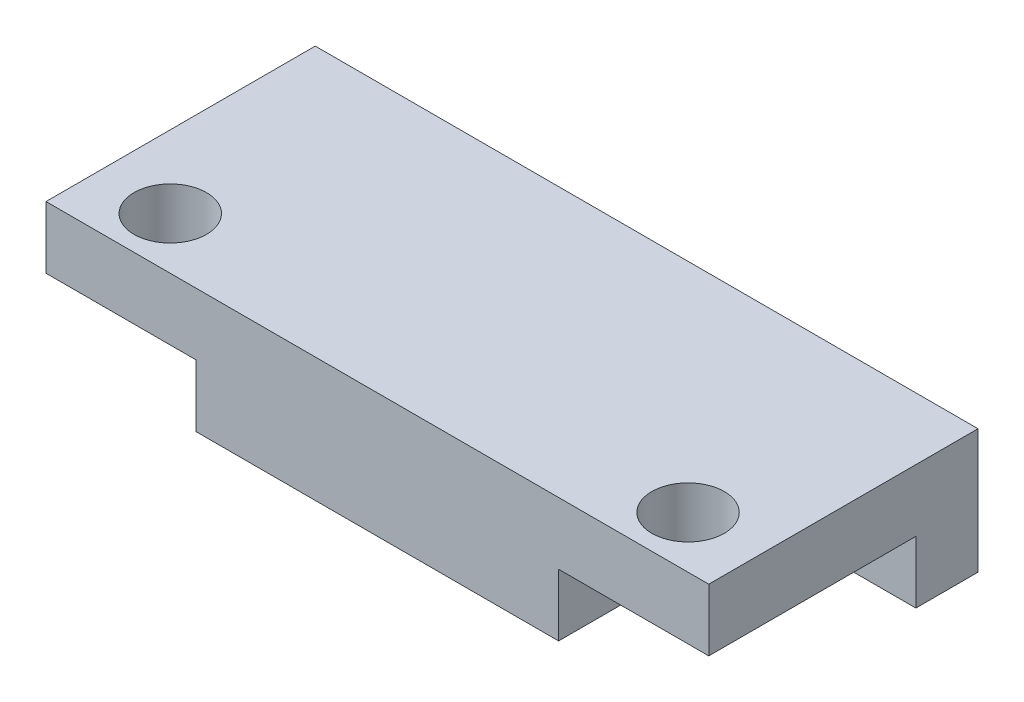
ISO-10303-21;
HEADER;
FILE_DESCRIPTION(('STEP AP214'),'2;1');
FILE_NAME('part.step','',(''),(''),'','','');
FILE_SCHEMA(('AUTOMOTIVE_DESIGN { 1 0 10303 214 1 1 1 1 }'));
ENDSEC;
DATA;
#1=APPLICATION_CONTEXT('core data for automotive mechanical design processes');
#2=APPLICATION_PROTOCOL_DEFINITION('international standard','automotive_design',2000,#1);
#3=PRODUCT_CONTEXT('',#1,'mechanical');
#4=PRODUCT('Part','Part','',(#3));
#5=PRODUCT_RELATED_PRODUCT_CATEGORY('part','',(#4));
#6=PRODUCT_DEFINITION_FORMATION('','',#4);
#7=PRODUCT_DEFINITION_CONTEXT('part definition',#1,'design');
#8=PRODUCT_DEFINITION('design','',#6,#7);
#9=PRODUCT_DEFINITION_SHAPE('','',#8);
#10=(LENGTH_UNIT() NAMED_UNIT(*) SI_UNIT(.MILLI.,.METRE.));
#11=(NAMED_UNIT(*) PLANE_ANGLE_UNIT() SI_UNIT($,.RADIAN.));
#12=(NAMED_UNIT(*) SI_UNIT($,.STERADIAN.) SOLID_ANGLE_UNIT());
#13=UNCERTAINTY_MEASURE_WITH_UNIT(LENGTH_MEASURE(1.E-05),#10,'distance_accuracy_value','');
#14=(GEOMETRIC_REPRESENTATION_CONTEXT(3) GLOBAL_UNCERTAINTY_ASSIGNED_CONTEXT((#13)) GLOBAL_UNIT_ASSIGNED_CONTEXT((#10,
#11,#12)) REPRESENTATION_CONTEXT('',''));
#15=CARTESIAN_POINT('',(0.,0.,0.));
#16=DIRECTION('',(0.,0.,1.));
#17=DIRECTION('',(1.,0.,0.));
#18=AXIS2_PLACEMENT_3D('',#15,#16,#17);
#19=CARTESIAN_POINT('',(0.,0.,0.));
#20=DIRECTION('',(0.,1.,0.));
#21=DIRECTION('',(0.,0.,1.));
#22=AXIS2_PLACEMENT_3D('',#19,#20,#21);
#23=PLANE('',#22);
#24=CARTESIAN_POINT('',(12.5,0.,4.));
#25=DIRECTION('',(0.,1.,0.));
#26=DIRECTION('',(0.,0.,1.));
#27=AXIS2_PLACEMENT_3D('',#24,#25,#26);
#28=CIRCLE('',#27,1.75);
#29=CARTESIAN_POINT('',(12.5,0.,5.75));
#30=VERTEX_POINT('',#29);
#31=EDGE_CURVE('E149',#30,#30,#28,.T.);
#32=ORIENTED_EDGE('',*,*,#31,.T.);
#33=EDGE_LOOP('',(#32));
#34=FACE_BOUND('',#33,.T.);
#35=DIRECTION('',(0.,0.,1.));
#36=VECTOR('',#35,1.);
#37=CARTESIAN_POINT('',(8.75,0.,6.5));
#38=LINE('',#37,#36);
#39=CARTESIAN_POINT('',(8.75,0.,-3.5));
#40=VERTEX_POINT('',#39);
#41=CARTESIAN_POINT('',(8.75,0.,6.5));
#42=VERTEX_POINT('',#41);
#43=EDGE_CURVE('E61',#40,#42,#38,.T.);
#44=ORIENTED_EDGE('',*,*,#43,.F.);
#45=DIRECTION('',(-1.,0.,0.));
#46=VECTOR('',#45,1.);
#47=CARTESIAN_POINT('',(8.75,0.,-3.5));
#48=LINE('',#47,#46);
#49=CARTESIAN_POINT('',(16.,0.,-3.49999999999999));
#50=VERTEX_POINT('',#49);
#51=EDGE_CURVE('E212',#50,#40,#48,.T.);
#52=ORIENTED_EDGE('',*,*,#51,.F.);
#53=DIRECTION('',(0.,0.,-1.));
#54=VECTOR('',#53,1.);
#55=CARTESIAN_POINT('',(16.,0.,6.5));
#56=LINE('',#55,#54);
#57=CARTESIAN_POINT('',(16.,0.,6.5));
#58=VERTEX_POINT('',#57);
#59=EDGE_CURVE('E177',#58,#50,#56,.T.);
#60=ORIENTED_EDGE('',*,*,#59,.F.);
#61=DIRECTION('',(1.,0.,0.));
#62=VECTOR('',#61,1.);
#63=CARTESIAN_POINT('',(16.,0.,6.5));
#64=LINE('',#63,#62);
#65=EDGE_CURVE('E189',#42,#58,#64,.T.);
#66=ORIENTED_EDGE('',*,*,#65,.F.);
#67=EDGE_LOOP('',(#44,#52,#60,#66));
#68=FACE_BOUND('',#67,.T.);
#69=ADVANCED_FACE('F45',(#34,#68),#23,.F.);
#70=CARTESIAN_POINT('',(-12.5,0.,4.));
#71=DIRECTION('',(0.,1.,0.));
#72=DIRECTION('',(0.,0.,1.));
#73=AXIS2_PLACEMENT_3D('',#70,#71,#72);
#74=CIRCLE('',#73,1.75);
#75=CARTESIAN_POINT('',(-12.5,0.,5.75));
#76=VERTEX_POINT('',#75);
#77=EDGE_CURVE('E160',#76,#76,#74,.T.);
#78=ORIENTED_EDGE('',*,*,#77,.T.);
#79=EDGE_LOOP('',(#78));
#80=FACE_BOUND('',#79,.T.);
#81=DIRECTION('',(0.,0.,-1.));
#82=VECTOR('',#81,1.);
#83=CARTESIAN_POINT('',(-8.75,0.,6.5));
#84=LINE('',#83,#82);
#85=CARTESIAN_POINT('',(-8.75,0.,6.5));
#86=VERTEX_POINT('',#85);
#87=CARTESIAN_POINT('',(-8.75,0.,-3.5));
#88=VERTEX_POINT('',#87);
#89=EDGE_CURVE('E147',#86,#88,#84,.T.);
#90=ORIENTED_EDGE('',*,*,#89,.F.);
#91=CARTESIAN_POINT('',(-16.,0.,6.5));
#92=VERTEX_POINT('',#91);
#93=EDGE_CURVE('E190',#92,#86,#64,.T.);
#94=ORIENTED_EDGE('',*,*,#93,.F.);
#95=DIRECTION('',(0.,0.,1.));
#96=VECTOR('',#95,1.);
#97=CARTESIAN_POINT('',(-16.,0.,6.5));
#98=LINE('',#97,#96);
#99=CARTESIAN_POINT('',(-16.,0.,-3.5));
#100=VERTEX_POINT('',#99);
#101=EDGE_CURVE('E164',#100,#92,#98,.T.);
#102=ORIENTED_EDGE('',*,*,#101,.F.);
#103=DIRECTION('',(-1.,0.,0.));
#104=VECTOR('',#103,1.);
#105=CARTESIAN_POINT('',(-16.,0.,-3.5));
#106=LINE('',#105,#104);
#107=EDGE_CURVE('E69',#88,#100,#106,.T.);
#108=ORIENTED_EDGE('',*,*,#107,.F.);
#109=EDGE_LOOP('',(#90,#94,#102,#108));
#110=FACE_BOUND('',#109,.T.);
#111=ADVANCED_FACE('F262',(#80,#110),#23,.F.);
#112=CARTESIAN_POINT('',(-16.,3.,6.5));
#113=DIRECTION('',(1.,0.,0.));
#114=DIRECTION('',(0.,0.,-1.));
#115=AXIS2_PLACEMENT_3D('',#112,#113,#114);
#116=PLANE('',#115);
#117=DIRECTION('',(0.,-1.,0.));
#118=VECTOR('',#117,1.);
#119=CARTESIAN_POINT('',(-16.,3.,-6.5));
#120=LINE('',#119,#118);
#121=CARTESIAN_POINT('',(-16.,3.,-6.5));
#122=VERTEX_POINT('',#121);
#123=CARTESIAN_POINT('',(-16.,-3.,-6.5));
#124=VERTEX_POINT('',#123);
#125=EDGE_CURVE('E186',#122,#124,#120,.T.);
#126=ORIENTED_EDGE('',*,*,#125,.T.);
#127=DIRECTION('',(0.,0.,-1.));
#128=VECTOR('',#127,1.);
#129=CARTESIAN_POINT('',(-16.,-3.,-6.5));
#130=LINE('',#129,#128);
#131=CARTESIAN_POINT('',(-16.,-3.,-3.5));
#132=VERTEX_POINT('',#131);
#133=EDGE_CURVE('E134',#132,#124,#130,.T.);
#134=ORIENTED_EDGE('',*,*,#133,.F.);
#135=DIRECTION('',(0.,1.,0.));
#136=VECTOR('',#135,1.);
#137=CARTESIAN_POINT('',(-16.,-3.,-3.5));
#138=LINE('',#137,#136);
#139=EDGE_CURVE('E129',#132,#100,#138,.T.);
#140=ORIENTED_EDGE('',*,*,#139,.T.);
#141=ORIENTED_EDGE('',*,*,#101,.T.);
#142=DIRECTION('',(0.,-1.,0.));
#143=VECTOR('',#142,1.);
#144=CARTESIAN_POINT('',(-16.,3.,6.5));
#145=LINE('',#144,#143);
#146=CARTESIAN_POINT('',(-16.,3.,6.5));
#147=VERTEX_POINT('',#146);
#148=EDGE_CURVE('E11',#147,#92,#145,.T.);
#149=ORIENTED_EDGE('',*,*,#148,.F.);
#150=DIRECTION('',(0.,0.,1.));
#151=VECTOR('',#150,1.);
#152=CARTESIAN_POINT('',(-16.,3.,6.5));
#153=LINE('',#152,#151);
#154=EDGE_CURVE('E172',#122,#147,#153,.T.);
#155=ORIENTED_EDGE('',*,*,#154,.F.);
#156=EDGE_LOOP('',(#126,#134,#140,#141,#149,#155));
#157=FACE_BOUND('',#156,.T.);
#158=ADVANCED_FACE('F47',(#157),#116,.F.);
#159=CARTESIAN_POINT('',(16.,3.,6.5));
#160=DIRECTION('',(0.,0.,-1.));
#161=DIRECTION('',(-1.,0.,0.));
#162=AXIS2_PLACEMENT_3D('',#159,#160,#161);
#163=PLANE('',#162);
#164=ORIENTED_EDGE('',*,*,#93,.T.);
#165=DIRECTION('',(0.,1.,0.));
#166=VECTOR('',#165,1.);
#167=CARTESIAN_POINT('',(-8.75,-3.,6.5));
#168=LINE('',#167,#166);
#169=CARTESIAN_POINT('',(-8.75,-3.,6.5));
#170=VERTEX_POINT('',#169);
#171=EDGE_CURVE('E224',#170,#86,#168,.T.);
#172=ORIENTED_EDGE('',*,*,#171,.F.);
#173=DIRECTION('',(-1.,0.,0.));
#174=VECTOR('',#173,1.);
#175=CARTESIAN_POINT('',(-8.75,-3.,6.5));
#176=LINE('',#175,#174);
#177=CARTESIAN_POINT('',(8.75,-3.,6.5));
#178=VERTEX_POINT('',#177);
#179=EDGE_CURVE('E140',#178,#170,#176,.T.);
#180=ORIENTED_EDGE('',*,*,#179,.F.);
#181=DIRECTION('',(0.,1.,0.));
#182=VECTOR('',#181,1.);
#183=CARTESIAN_POINT('',(8.75,-3.,6.5));
#184=LINE('',#183,#182);
#185=EDGE_CURVE('E227',#178,#42,#184,.T.);
#186=ORIENTED_EDGE('',*,*,#185,.T.);
#187=ORIENTED_EDGE('',*,*,#65,.T.);
#188=DIRECTION('',(0.,-1.,0.));
#189=VECTOR('',#188,1.);
#190=CARTESIAN_POINT('',(16.,3.,6.5));
#191=LINE('',#190,#189);
#192=CARTESIAN_POINT('',(16.,3.,6.5));
#193=VERTEX_POINT('',#192);
#194=EDGE_CURVE('E54',#193,#58,#191,.T.);
#195=ORIENTED_EDGE('',*,*,#194,.F.);
#196=DIRECTION('',(1.,0.,0.));
#197=VECTOR('',#196,1.);
#198=CARTESIAN_POINT('',(16.,3.,6.5));
#199=LINE('',#198,#197);
#200=EDGE_CURVE('E176',#147,#193,#199,.T.);
#201=ORIENTED_EDGE('',*,*,#200,.F.);
#202=ORIENTED_EDGE('',*,*,#148,.T.);
#203=EDGE_LOOP('',(#164,#172,#180,#186,#187,#195,#201,#202));
#204=FACE_BOUND('',#203,.T.);
#205=ADVANCED_FACE('F259',(#204),#163,.F.);
#206=CARTESIAN_POINT('',(16.,3.,6.5));
#207=DIRECTION('',(-1.,0.,0.));
#208=DIRECTION('',(0.,0.,1.));
#209=AXIS2_PLACEMENT_3D('',#206,#207,#208);
#210=PLANE('',#209);
#211=ORIENTED_EDGE('',*,*,#59,.T.);
#212=DIRECTION('',(0.,1.,0.));
#213=VECTOR('',#212,1.);
#214=CARTESIAN_POINT('',(16.,-3.,-3.5));
#215=LINE('',#214,#213);
#216=CARTESIAN_POINT('',(16.,-3.,-3.5));
#217=VERTEX_POINT('',#216);
#218=EDGE_CURVE('E156',#217,#50,#215,.T.);
#219=ORIENTED_EDGE('',*,*,#218,.F.);
#220=DIRECTION('',(0.,0.,1.));
#221=VECTOR('',#220,1.);
#222=CARTESIAN_POINT('',(16.,-3.,-3.5));
#223=LINE('',#222,#221);
#224=CARTESIAN_POINT('',(16.,-3.,-6.5));
#225=VERTEX_POINT('',#224);
#226=EDGE_CURVE('E238',#225,#217,#223,.T.);
#227=ORIENTED_EDGE('',*,*,#226,.F.);
#228=DIRECTION('',(0.,-1.,0.));
#229=VECTOR('',#228,1.);
#230=CARTESIAN_POINT('',(16.,3.,-6.5));
#231=LINE('',#230,#229);
#232=CARTESIAN_POINT('',(16.,3.,-6.5));
#233=VERTEX_POINT('',#232);
#234=EDGE_CURVE('E199',#233,#225,#231,.T.);
#235=ORIENTED_EDGE('',*,*,#234,.F.);
#236=DIRECTION('',(0.,0.,-1.));
#237=VECTOR('',#236,1.);
#238=CARTESIAN_POINT('',(16.,3.,6.5));
#239=LINE('',#238,#237);
#240=EDGE_CURVE('E180',#193,#233,#239,.T.);
#241=ORIENTED_EDGE('',*,*,#240,.F.);
#242=ORIENTED_EDGE('',*,*,#194,.T.);
#243=EDGE_LOOP('',(#211,#219,#227,#235,#241,#242));
#244=FACE_BOUND('',#243,.T.);
#245=ADVANCED_FACE('F207',(#244),#210,.F.);
#246=CARTESIAN_POINT('',(16.,3.,-6.5));
#247=DIRECTION('',(0.,0.,1.));
#248=DIRECTION('',(1.,0.,0.));
#249=AXIS2_PLACEMENT_3D('',#246,#247,#248);
#250=PLANE('',#249);
#251=ORIENTED_EDGE('',*,*,#234,.T.);
#252=DIRECTION('',(1.,0.,0.));
#253=VECTOR('',#252,1.);
#254=CARTESIAN_POINT('',(-16.,-3.,-6.5));
#255=LINE('',#254,#253);
#256=EDGE_CURVE('E242',#124,#225,#255,.T.);
#257=ORIENTED_EDGE('',*,*,#256,.F.);
#258=ORIENTED_EDGE('',*,*,#125,.F.);
#259=DIRECTION('',(-1.,0.,0.));
#260=VECTOR('',#259,1.);
#261=CARTESIAN_POINT('',(16.,3.,-6.5));
#262=LINE('',#261,#260);
#263=EDGE_CURVE('E183',#233,#122,#262,.T.);
#264=ORIENTED_EDGE('',*,*,#263,.F.);
#265=EDGE_LOOP('',(#251,#257,#258,#264));
#266=FACE_BOUND('',#265,.T.);
#267=ADVANCED_FACE('F269',(#266),#250,.F.);
#268=CARTESIAN_POINT('',(0.,3.,0.));
#269=DIRECTION('',(0.,1.,0.));
#270=DIRECTION('',(0.,0.,1.));
#271=AXIS2_PLACEMENT_3D('',#268,#269,#270);
#272=PLANE('',#271);
#273=CARTESIAN_POINT('',(-12.5,3.,4.));
#274=DIRECTION('',(0.,1.,0.));
#275=DIRECTION('',(0.,0.,1.));
#276=AXIS2_PLACEMENT_3D('',#273,#274,#275);
#277=CIRCLE('',#276,1.75);
#278=CARTESIAN_POINT('',(-12.5,3.,5.75));
#279=VERTEX_POINT('',#278);
#280=EDGE_CURVE('E165',#279,#279,#277,.T.);
#281=ORIENTED_EDGE('',*,*,#280,.F.);
#282=EDGE_LOOP('',(#281));
#283=FACE_BOUND('',#282,.T.);
#284=CARTESIAN_POINT('',(12.5,3.,4.));
#285=DIRECTION('',(0.,1.,0.));
#286=DIRECTION('',(0.,0.,1.));
#287=AXIS2_PLACEMENT_3D('',#284,#285,#286);
#288=CIRCLE('',#287,1.75);
#289=CARTESIAN_POINT('',(12.5,3.,5.75));
#290=VERTEX_POINT('',#289);
#291=EDGE_CURVE('E154',#290,#290,#288,.T.);
#292=ORIENTED_EDGE('',*,*,#291,.F.);
#293=EDGE_LOOP('',(#292));
#294=FACE_BOUND('',#293,.T.);
#295=ORIENTED_EDGE('',*,*,#154,.T.);
#296=ORIENTED_EDGE('',*,*,#200,.T.);
#297=ORIENTED_EDGE('',*,*,#240,.T.);
#298=ORIENTED_EDGE('',*,*,#263,.T.);
#299=EDGE_LOOP('',(#295,#296,#297,#298));
#300=FACE_BOUND('',#299,.T.);
#301=ADVANCED_FACE('F271',(#283,#294,#300),#272,.T.);
#302=CARTESIAN_POINT('',(12.5,0.,4.));
#303=DIRECTION('',(0.,1.,0.));
#304=DIRECTION('',(0.,0.,1.));
#305=AXIS2_PLACEMENT_3D('',#302,#303,#304);
#306=CYLINDRICAL_SURFACE('',#305,1.75);
#307=ORIENTED_EDGE('',*,*,#31,.F.);
#308=EDGE_LOOP('',(#307));
#309=FACE_BOUND('',#308,.T.);
#310=ORIENTED_EDGE('',*,*,#291,.T.);
#311=EDGE_LOOP('',(#310));
#312=FACE_BOUND('',#311,.T.);
#313=ADVANCED_FACE('F273',(#309,#312),#306,.F.);
#314=CARTESIAN_POINT('',(-12.5,0.,4.));
#315=DIRECTION('',(0.,1.,0.));
#316=DIRECTION('',(0.,0.,1.));
#317=AXIS2_PLACEMENT_3D('',#314,#315,#316);
#318=CYLINDRICAL_SURFACE('',#317,1.75);
#319=ORIENTED_EDGE('',*,*,#77,.F.);
#320=EDGE_LOOP('',(#319));
#321=FACE_BOUND('',#320,.T.);
#322=ORIENTED_EDGE('',*,*,#280,.T.);
#323=EDGE_LOOP('',(#322));
#324=FACE_BOUND('',#323,.T.);
#325=ADVANCED_FACE('F279',(#321,#324),#318,.F.);
#326=CARTESIAN_POINT('',(-8.75,-3.,6.5));
#327=DIRECTION('',(1.,0.,0.));
#328=DIRECTION('',(0.,0.,-1.));
#329=AXIS2_PLACEMENT_3D('',#326,#327,#328);
#330=PLANE('',#329);
#331=ORIENTED_EDGE('',*,*,#89,.T.);
#332=DIRECTION('',(0.,1.,0.));
#333=VECTOR('',#332,1.);
#334=CARTESIAN_POINT('',(-8.75,-3.,-3.5));
#335=LINE('',#334,#333);
#336=CARTESIAN_POINT('',(-8.75,-3.,-3.5));
#337=VERTEX_POINT('',#336);
#338=EDGE_CURVE('E126',#337,#88,#335,.T.);
#339=ORIENTED_EDGE('',*,*,#338,.F.);
#340=DIRECTION('',(0.,0.,-1.));
#341=VECTOR('',#340,1.);
#342=CARTESIAN_POINT('',(-8.75,-3.,6.5));
#343=LINE('',#342,#341);
#344=EDGE_CURVE('E135',#170,#337,#343,.T.);
#345=ORIENTED_EDGE('',*,*,#344,.F.);
#346=ORIENTED_EDGE('',*,*,#171,.T.);
#347=EDGE_LOOP('',(#331,#339,#345,#346));
#348=FACE_BOUND('',#347,.T.);
#349=ADVANCED_FACE('F146',(#348),#330,.F.);
#350=CARTESIAN_POINT('',(-16.,-3.,-3.5));
#351=DIRECTION('',(0.,0.,-1.));
#352=DIRECTION('',(-1.,0.,0.));
#353=AXIS2_PLACEMENT_3D('',#350,#351,#352);
#354=PLANE('',#353);
#355=ORIENTED_EDGE('',*,*,#107,.T.);
#356=ORIENTED_EDGE('',*,*,#139,.F.);
#357=DIRECTION('',(-1.,0.,0.));
#358=VECTOR('',#357,1.);
#359=CARTESIAN_POINT('',(-16.,-3.,-3.5));
#360=LINE('',#359,#358);
#361=EDGE_CURVE('E122',#337,#132,#360,.T.);
#362=ORIENTED_EDGE('',*,*,#361,.F.);
#363=ORIENTED_EDGE('',*,*,#338,.T.);
#364=EDGE_LOOP('',(#355,#356,#362,#363));
#365=FACE_BOUND('',#364,.T.);
#366=ADVANCED_FACE('F124',(#365),#354,.F.);
#367=CARTESIAN_POINT('',(8.75,-3.,-3.5));
#368=DIRECTION('',(0.,0.,-1.));
#369=DIRECTION('',(-1.,0.,0.));
#370=AXIS2_PLACEMENT_3D('',#367,#368,#369);
#371=PLANE('',#370);
#372=ORIENTED_EDGE('',*,*,#51,.T.);
#373=DIRECTION('',(0.,1.,0.));
#374=VECTOR('',#373,1.);
#375=CARTESIAN_POINT('',(8.75,-3.,-3.5));
#376=LINE('',#375,#374);
#377=CARTESIAN_POINT('',(8.75,-3.,-3.5));
#378=VERTEX_POINT('',#377);
#379=EDGE_CURVE('E231',#378,#40,#376,.T.);
#380=ORIENTED_EDGE('',*,*,#379,.F.);
#381=DIRECTION('',(-1.,0.,0.));
#382=VECTOR('',#381,1.);
#383=CARTESIAN_POINT('',(8.75,-3.,-3.5));
#384=LINE('',#383,#382);
#385=EDGE_CURVE('E236',#217,#378,#384,.T.);
#386=ORIENTED_EDGE('',*,*,#385,.F.);
#387=ORIENTED_EDGE('',*,*,#218,.T.);
#388=EDGE_LOOP('',(#372,#380,#386,#387));
#389=FACE_BOUND('',#388,.T.);
#390=ADVANCED_FACE('F235',(#389),#371,.F.);
#391=CARTESIAN_POINT('',(8.75,-3.,6.5));
#392=DIRECTION('',(-1.,0.,0.));
#393=DIRECTION('',(0.,0.,1.));
#394=AXIS2_PLACEMENT_3D('',#391,#392,#393);
#395=PLANE('',#394);
#396=ORIENTED_EDGE('',*,*,#43,.T.);
#397=ORIENTED_EDGE('',*,*,#185,.F.);
#398=DIRECTION('',(0.,0.,1.));
#399=VECTOR('',#398,1.);
#400=CARTESIAN_POINT('',(8.75,-3.,6.5));
#401=LINE('',#400,#399);
#402=EDGE_CURVE('E246',#378,#178,#401,.T.);
#403=ORIENTED_EDGE('',*,*,#402,.F.);
#404=ORIENTED_EDGE('',*,*,#379,.T.);
#405=EDGE_LOOP('',(#396,#397,#403,#404));
#406=FACE_BOUND('',#405,.T.);
#407=ADVANCED_FACE('F258',(#406),#395,.F.);
#408=CARTESIAN_POINT('',(0.,-3.,0.));
#409=DIRECTION('',(0.,-1.,0.));
#410=DIRECTION('',(0.,0.,-1.));
#411=AXIS2_PLACEMENT_3D('',#408,#409,#410);
#412=PLANE('',#411);
#413=ORIENTED_EDGE('',*,*,#344,.T.);
#414=ORIENTED_EDGE('',*,*,#361,.T.);
#415=ORIENTED_EDGE('',*,*,#133,.T.);
#416=ORIENTED_EDGE('',*,*,#256,.T.);
#417=ORIENTED_EDGE('',*,*,#226,.T.);
#418=ORIENTED_EDGE('',*,*,#385,.T.);
#419=ORIENTED_EDGE('',*,*,#402,.T.);
#420=ORIENTED_EDGE('',*,*,#179,.T.);
#421=EDGE_LOOP('',(#413,#414,#415,#416,#417,#418,#419,#420));
#422=FACE_BOUND('',#421,.T.);
#423=ADVANCED_FACE('F138',(#422),#412,.T.);
#424=CLOSED_SHELL('',(#69,#111,#158,#205,#245,#267,#301,#313,#325,#349,#366,#390,#407,#423));
#425=MANIFOLD_SOLID_BREP('B2',#424);
#426=ADVANCED_BREP_SHAPE_REPRESENTATION('',(#18,#425),#14);
#427=SHAPE_DEFINITION_REPRESENTATION(#9,#426);
ENDSEC;
END-ISO-10303-21;
